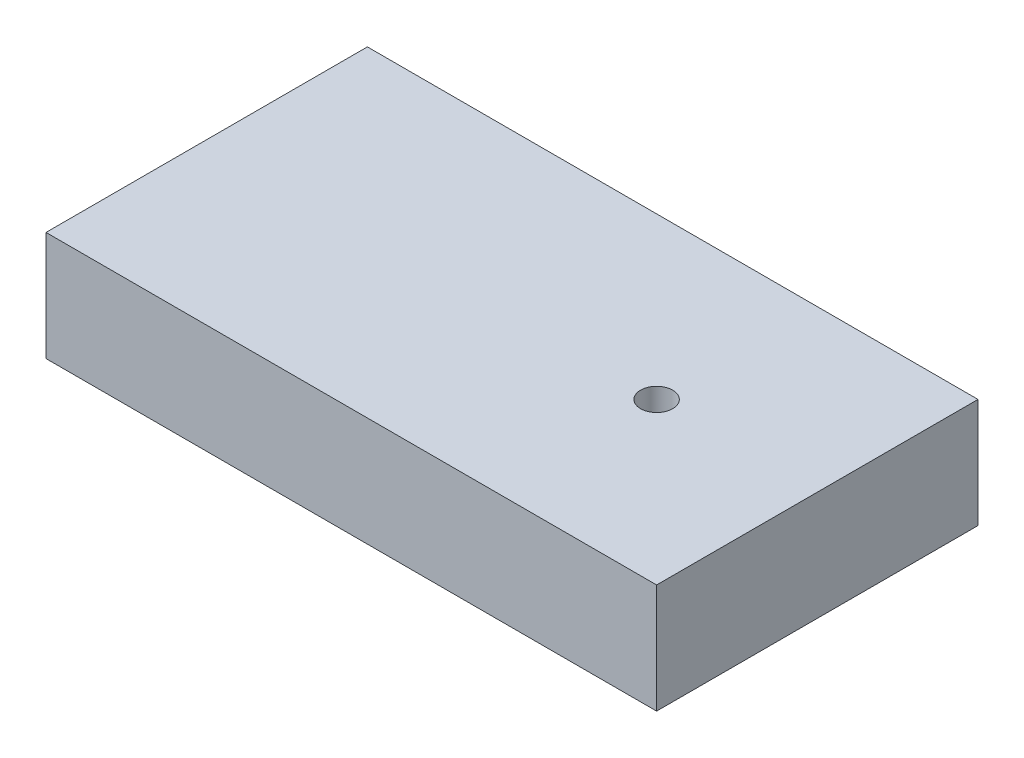
ISO-10303-21;
HEADER;
FILE_DESCRIPTION(('STEP AP214'),'2;1');
FILE_NAME('part.step','',(''),(''),'','','');
FILE_SCHEMA(('AUTOMOTIVE_DESIGN { 1 0 10303 214 1 1 1 1 }'));
ENDSEC;
DATA;
#1=APPLICATION_CONTEXT('core data for automotive mechanical design processes');
#2=APPLICATION_PROTOCOL_DEFINITION('international standard','automotive_design',2000,#1);
#3=PRODUCT_CONTEXT('',#1,'mechanical');
#4=PRODUCT('Part','Part','',(#3));
#5=PRODUCT_RELATED_PRODUCT_CATEGORY('part','',(#4));
#6=PRODUCT_DEFINITION_FORMATION('','',#4);
#7=PRODUCT_DEFINITION_CONTEXT('part definition',#1,'design');
#8=PRODUCT_DEFINITION('design','',#6,#7);
#9=PRODUCT_DEFINITION_SHAPE('','',#8);
#10=(LENGTH_UNIT() NAMED_UNIT(*) SI_UNIT(.MILLI.,.METRE.));
#11=(NAMED_UNIT(*) PLANE_ANGLE_UNIT() SI_UNIT($,.RADIAN.));
#12=(NAMED_UNIT(*) SI_UNIT($,.STERADIAN.) SOLID_ANGLE_UNIT());
#13=UNCERTAINTY_MEASURE_WITH_UNIT(LENGTH_MEASURE(1.E-05),#10,'distance_accuracy_value','');
#14=(GEOMETRIC_REPRESENTATION_CONTEXT(3) GLOBAL_UNCERTAINTY_ASSIGNED_CONTEXT((#13)) GLOBAL_UNIT_ASSIGNED_CONTEXT((#10,
#11,#12)) REPRESENTATION_CONTEXT('',''));
#15=CARTESIAN_POINT('',(0.,0.,0.));
#16=DIRECTION('',(0.,0.,1.));
#17=DIRECTION('',(1.,0.,0.));
#18=AXIS2_PLACEMENT_3D('',#15,#16,#17);
#19=CARTESIAN_POINT('',(0.,8.636,0.));
#20=DIRECTION('',(1.,0.,0.));
#21=DIRECTION('',(0.,0.,-1.));
#22=AXIS2_PLACEMENT_3D('',#19,#20,#21);
#23=PLANE('',#22);
#24=DIRECTION('',(0.,0.,1.));
#25=VECTOR('',#24,1.);
#26=CARTESIAN_POINT('',(0.,0.,0.));
#27=LINE('',#26,#25);
#28=CARTESIAN_POINT('',(0.,0.,-25.4));
#29=VERTEX_POINT('',#28);
#30=CARTESIAN_POINT('',(0.,0.,0.));
#31=VERTEX_POINT('',#30);
#32=EDGE_CURVE('E96',#29,#31,#27,.T.);
#33=ORIENTED_EDGE('',*,*,#32,.T.);
#34=DIRECTION('',(0.,-1.,0.));
#35=VECTOR('',#34,1.);
#36=CARTESIAN_POINT('',(0.,8.636,0.));
#37=LINE('',#36,#35);
#38=CARTESIAN_POINT('',(0.,8.636,0.));
#39=VERTEX_POINT('',#38);
#40=EDGE_CURVE('E11',#39,#31,#37,.T.);
#41=ORIENTED_EDGE('',*,*,#40,.F.);
#42=DIRECTION('',(0.,0.,1.));
#43=VECTOR('',#42,1.);
#44=CARTESIAN_POINT('',(0.,8.636,0.));
#45=LINE('',#44,#43);
#46=CARTESIAN_POINT('',(0.,8.636,-25.4));
#47=VERTEX_POINT('',#46);
#48=EDGE_CURVE('E84',#47,#39,#45,.T.);
#49=ORIENTED_EDGE('',*,*,#48,.F.);
#50=DIRECTION('',(0.,-1.,0.));
#51=VECTOR('',#50,1.);
#52=CARTESIAN_POINT('',(0.,8.636,-25.4));
#53=LINE('',#52,#51);
#54=EDGE_CURVE('E92',#47,#29,#53,.T.);
#55=ORIENTED_EDGE('',*,*,#54,.T.);
#56=EDGE_LOOP('',(#33,#41,#49,#55));
#57=FACE_BOUND('',#56,.T.);
#58=ADVANCED_FACE('F33',(#57),#23,.F.);
#59=CARTESIAN_POINT('',(0.,8.636,0.));
#60=DIRECTION('',(0.,0.,-1.));
#61=DIRECTION('',(-1.,0.,0.));
#62=AXIS2_PLACEMENT_3D('',#59,#60,#61);
#63=PLANE('',#62);
#64=DIRECTION('',(1.,0.,0.));
#65=VECTOR('',#64,1.);
#66=CARTESIAN_POINT('',(0.,0.,0.));
#67=LINE('',#66,#65);
#68=CARTESIAN_POINT('',(48.26,0.,0.));
#69=VERTEX_POINT('',#68);
#70=EDGE_CURVE('E88',#31,#69,#67,.T.);
#71=ORIENTED_EDGE('',*,*,#70,.T.);
#72=DIRECTION('',(0.,-1.,0.));
#73=VECTOR('',#72,1.);
#74=CARTESIAN_POINT('',(48.26,8.636,0.));
#75=LINE('',#74,#73);
#76=CARTESIAN_POINT('',(48.26,8.636,0.));
#77=VERTEX_POINT('',#76);
#78=EDGE_CURVE('E41',#77,#69,#75,.T.);
#79=ORIENTED_EDGE('',*,*,#78,.F.);
#80=DIRECTION('',(1.,0.,0.));
#81=VECTOR('',#80,1.);
#82=CARTESIAN_POINT('',(0.,8.636,0.));
#83=LINE('',#82,#81);
#84=EDGE_CURVE('E79',#39,#77,#83,.T.);
#85=ORIENTED_EDGE('',*,*,#84,.F.);
#86=ORIENTED_EDGE('',*,*,#40,.T.);
#87=EDGE_LOOP('',(#71,#79,#85,#86));
#88=FACE_BOUND('',#87,.T.);
#89=ADVANCED_FACE('F87',(#88),#63,.F.);
#90=CARTESIAN_POINT('',(48.26,8.636,0.));
#91=DIRECTION('',(-1.,0.,0.));
#92=DIRECTION('',(0.,0.,1.));
#93=AXIS2_PLACEMENT_3D('',#90,#91,#92);
#94=PLANE('',#93);
#95=DIRECTION('',(0.,0.,-1.));
#96=VECTOR('',#95,1.);
#97=CARTESIAN_POINT('',(48.26,0.,0.));
#98=LINE('',#97,#96);
#99=CARTESIAN_POINT('',(48.26,0.,-25.4));
#100=VERTEX_POINT('',#99);
#101=EDGE_CURVE('E66',#69,#100,#98,.T.);
#102=ORIENTED_EDGE('',*,*,#101,.T.);
#103=DIRECTION('',(0.,-1.,0.));
#104=VECTOR('',#103,1.);
#105=CARTESIAN_POINT('',(48.26,8.636,-25.4));
#106=LINE('',#105,#104);
#107=CARTESIAN_POINT('',(48.26,8.636,-25.4));
#108=VERTEX_POINT('',#107);
#109=EDGE_CURVE('E89',#108,#100,#106,.T.);
#110=ORIENTED_EDGE('',*,*,#109,.F.);
#111=DIRECTION('',(0.,0.,-1.));
#112=VECTOR('',#111,1.);
#113=CARTESIAN_POINT('',(48.26,8.636,0.));
#114=LINE('',#113,#112);
#115=EDGE_CURVE('E82',#77,#108,#114,.T.);
#116=ORIENTED_EDGE('',*,*,#115,.F.);
#117=ORIENTED_EDGE('',*,*,#78,.T.);
#118=EDGE_LOOP('',(#102,#110,#116,#117));
#119=FACE_BOUND('',#118,.T.);
#120=ADVANCED_FACE('F90',(#119),#94,.F.);
#121=CARTESIAN_POINT('',(0.,8.636,-25.4));
#122=DIRECTION('',(0.,0.,1.));
#123=DIRECTION('',(1.,0.,0.));
#124=AXIS2_PLACEMENT_3D('',#121,#122,#123);
#125=PLANE('',#124);
#126=DIRECTION('',(-1.,0.,0.));
#127=VECTOR('',#126,1.);
#128=CARTESIAN_POINT('',(0.,0.,-25.4));
#129=LINE('',#128,#127);
#130=EDGE_CURVE('E72',#100,#29,#129,.T.);
#131=ORIENTED_EDGE('',*,*,#130,.T.);
#132=ORIENTED_EDGE('',*,*,#54,.F.);
#133=DIRECTION('',(-1.,0.,0.));
#134=VECTOR('',#133,1.);
#135=CARTESIAN_POINT('',(0.,8.636,-25.4));
#136=LINE('',#135,#134);
#137=EDGE_CURVE('E49',#108,#47,#136,.T.);
#138=ORIENTED_EDGE('',*,*,#137,.F.);
#139=ORIENTED_EDGE('',*,*,#109,.T.);
#140=EDGE_LOOP('',(#131,#132,#138,#139));
#141=FACE_BOUND('',#140,.T.);
#142=ADVANCED_FACE('F104',(#141),#125,.F.);
#143=CARTESIAN_POINT('',(0.,8.636,0.));
#144=DIRECTION('',(0.,-1.,0.));
#145=DIRECTION('',(0.,0.,-1.));
#146=AXIS2_PLACEMENT_3D('',#143,#144,#145);
#147=PLANE('',#146);
#148=CARTESIAN_POINT('',(35.56,8.636,-12.7));
#149=DIRECTION('',(0.,1.,0.));
#150=DIRECTION('',(0.,0.,1.));
#151=AXIS2_PLACEMENT_3D('',#148,#149,#150);
#152=CIRCLE('',#151,1.27);
#153=CARTESIAN_POINT('',(35.56,8.636,-11.43));
#154=VERTEX_POINT('',#153);
#155=EDGE_CURVE('E110',#154,#154,#152,.T.);
#156=ORIENTED_EDGE('',*,*,#155,.F.);
#157=EDGE_LOOP('',(#156));
#158=FACE_BOUND('',#157,.T.);
#159=ORIENTED_EDGE('',*,*,#48,.T.);
#160=ORIENTED_EDGE('',*,*,#84,.T.);
#161=ORIENTED_EDGE('',*,*,#115,.T.);
#162=ORIENTED_EDGE('',*,*,#137,.T.);
#163=EDGE_LOOP('',(#159,#160,#161,#162));
#164=FACE_BOUND('',#163,.T.);
#165=ADVANCED_FACE('F80',(#158,#164),#147,.F.);
#166=CARTESIAN_POINT('',(0.,0.,0.));
#167=DIRECTION('',(0.,-1.,0.));
#168=DIRECTION('',(0.,0.,-1.));
#169=AXIS2_PLACEMENT_3D('',#166,#167,#168);
#170=PLANE('',#169);
#171=CARTESIAN_POINT('',(35.56,0.,-12.7));
#172=DIRECTION('',(0.,1.,0.));
#173=DIRECTION('',(0.,0.,1.));
#174=AXIS2_PLACEMENT_3D('',#171,#172,#173);
#175=CIRCLE('',#174,1.27);
#176=CARTESIAN_POINT('',(35.56,0.,-11.43));
#177=VERTEX_POINT('',#176);
#178=EDGE_CURVE('E99',#177,#177,#175,.T.);
#179=ORIENTED_EDGE('',*,*,#178,.T.);
#180=EDGE_LOOP('',(#179));
#181=FACE_BOUND('',#180,.T.);
#182=ORIENTED_EDGE('',*,*,#32,.F.);
#183=ORIENTED_EDGE('',*,*,#130,.F.);
#184=ORIENTED_EDGE('',*,*,#101,.F.);
#185=ORIENTED_EDGE('',*,*,#70,.F.);
#186=EDGE_LOOP('',(#182,#183,#184,#185));
#187=FACE_BOUND('',#186,.T.);
#188=ADVANCED_FACE('F107',(#181,#187),#170,.T.);
#189=CARTESIAN_POINT('',(35.56,0.,-12.7));
#190=DIRECTION('',(0.,1.,0.));
#191=DIRECTION('',(0.,0.,1.));
#192=AXIS2_PLACEMENT_3D('',#189,#190,#191);
#193=CYLINDRICAL_SURFACE('',#192,1.27);
#194=ORIENTED_EDGE('',*,*,#178,.F.);
#195=EDGE_LOOP('',(#194));
#196=FACE_BOUND('',#195,.T.);
#197=ORIENTED_EDGE('',*,*,#155,.T.);
#198=EDGE_LOOP('',(#197));
#199=FACE_BOUND('',#198,.T.);
#200=ADVANCED_FACE('F117',(#196,#199),#193,.F.);
#201=CLOSED_SHELL('',(#58,#89,#120,#142,#165,#188,#200));
#202=MANIFOLD_SOLID_BREP('B2',#201);
#203=ADVANCED_BREP_SHAPE_REPRESENTATION('',(#18,#202),#14);
#204=SHAPE_DEFINITION_REPRESENTATION(#9,#203);
ENDSEC;
END-ISO-10303-21;
